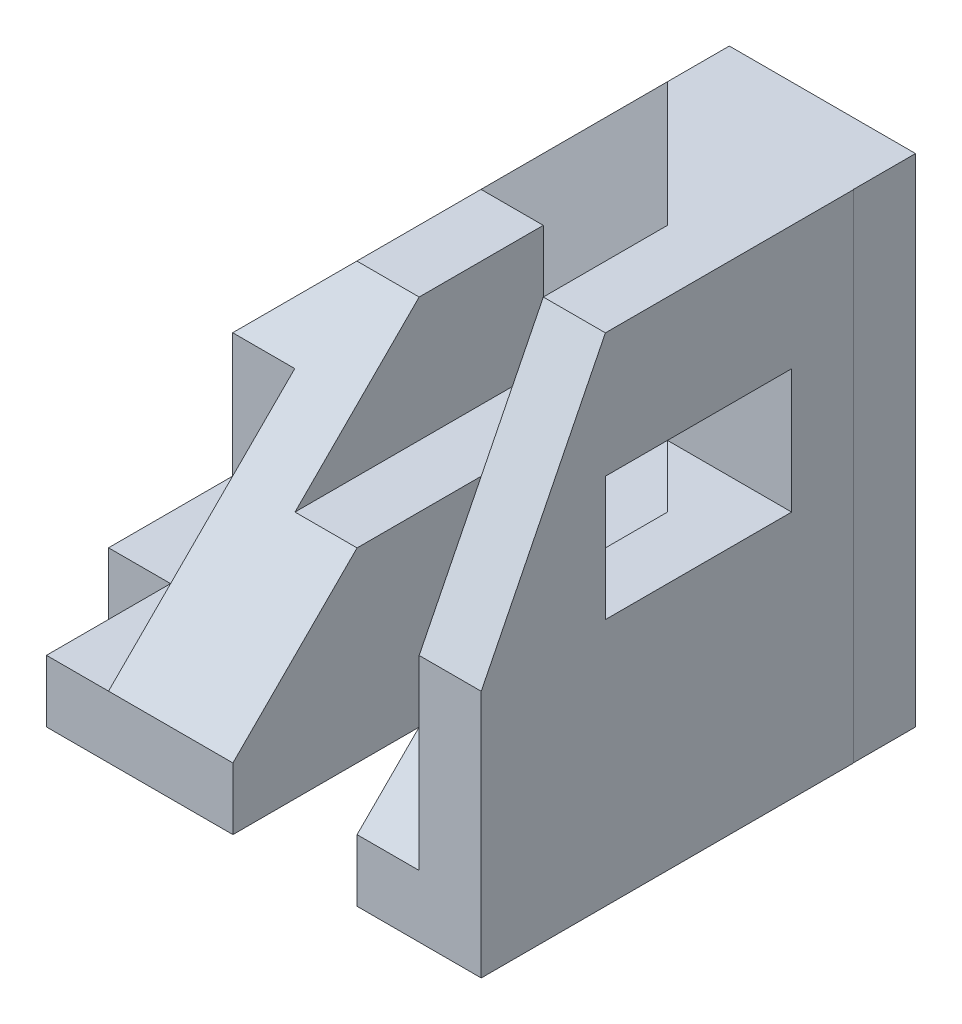
ISO-10303-21;
HEADER;
FILE_DESCRIPTION(('STEP AP214'),'2;1');
FILE_NAME('part.step','',(''),(''),'','','');
FILE_SCHEMA(('AUTOMOTIVE_DESIGN { 1 0 10303 214 1 1 1 1 }'));
ENDSEC;
DATA;
#1=APPLICATION_CONTEXT('core data for automotive mechanical design processes');
#2=APPLICATION_PROTOCOL_DEFINITION('international standard','automotive_design',2000,#1);
#3=PRODUCT_CONTEXT('',#1,'mechanical');
#4=PRODUCT('Part','Part','',(#3));
#5=PRODUCT_RELATED_PRODUCT_CATEGORY('part','',(#4));
#6=PRODUCT_DEFINITION_FORMATION('','',#4);
#7=PRODUCT_DEFINITION_CONTEXT('part definition',#1,'design');
#8=PRODUCT_DEFINITION('design','',#6,#7);
#9=PRODUCT_DEFINITION_SHAPE('','',#8);
#10=(LENGTH_UNIT() NAMED_UNIT(*) SI_UNIT(.MILLI.,.METRE.));
#11=(NAMED_UNIT(*) PLANE_ANGLE_UNIT() SI_UNIT($,.RADIAN.));
#12=(NAMED_UNIT(*) SI_UNIT($,.STERADIAN.) SOLID_ANGLE_UNIT());
#13=UNCERTAINTY_MEASURE_WITH_UNIT(LENGTH_MEASURE(1.E-05),#10,'distance_accuracy_value','');
#14=(GEOMETRIC_REPRESENTATION_CONTEXT(3) GLOBAL_UNCERTAINTY_ASSIGNED_CONTEXT((#13)) GLOBAL_UNIT_ASSIGNED_CONTEXT((#10,
#11,#12)) REPRESENTATION_CONTEXT('',''));
#15=CARTESIAN_POINT('',(0.,0.,0.));
#16=DIRECTION('',(0.,0.,1.));
#17=DIRECTION('',(1.,0.,0.));
#18=AXIS2_PLACEMENT_3D('',#15,#16,#17);
#19=CARTESIAN_POINT('',(0.,0.,1.));
#20=DIRECTION('',(0.,0.,-1.));
#21=DIRECTION('',(-1.,0.,0.));
#22=AXIS2_PLACEMENT_3D('',#19,#20,#21);
#23=PLANE('',#22);
#24=DIRECTION('',(0.,-1.,0.));
#25=VECTOR('',#24,1.);
#26=CARTESIAN_POINT('',(5.00380266007494,8.,1.));
#27=LINE('',#26,#25);
#28=CARTESIAN_POINT('',(5.00380266007494,8.,1.));
#29=VERTEX_POINT('',#28);
#30=CARTESIAN_POINT('',(5.00380266007494,3.,1.));
#31=VERTEX_POINT('',#30);
#32=EDGE_CURVE('E451',#29,#31,#27,.T.);
#33=ORIENTED_EDGE('',*,*,#32,.F.);
#34=DIRECTION('',(-1.,0.,0.));
#35=VECTOR('',#34,1.);
#36=CARTESIAN_POINT('',(5.,8.,1.));
#37=LINE('',#36,#35);
#38=CARTESIAN_POINT('',(5.,8.,1.));
#39=VERTEX_POINT('',#38);
#40=EDGE_CURVE('E514',#29,#39,#37,.T.);
#41=ORIENTED_EDGE('',*,*,#40,.T.);
#42=DIRECTION('',(-0.707106781186547,-0.707106781186548,0.));
#43=VECTOR('',#42,1.);
#44=CARTESIAN_POINT('',(0.,3.,1.));
#45=LINE('',#44,#43);
#46=CARTESIAN_POINT('',(2.,5.,1.));
#47=VERTEX_POINT('',#46);
#48=EDGE_CURVE('E510',#39,#47,#45,.T.);
#49=ORIENTED_EDGE('',*,*,#48,.T.);
#50=DIRECTION('',(-1.,0.,0.));
#51=VECTOR('',#50,1.);
#52=CARTESIAN_POINT('',(2.,5.,1.));
#53=LINE('',#52,#51);
#54=CARTESIAN_POINT('',(3.00380266007494,5.,1.));
#55=VERTEX_POINT('',#54);
#56=EDGE_CURVE('E420',#55,#47,#53,.T.);
#57=ORIENTED_EDGE('',*,*,#56,.F.);
#58=DIRECTION('',(0.,1.,0.));
#59=VECTOR('',#58,1.);
#60=CARTESIAN_POINT('',(3.00380266007494,5.,1.));
#61=LINE('',#60,#59);
#62=CARTESIAN_POINT('',(3.00380266007494,3.,1.));
#63=VERTEX_POINT('',#62);
#64=EDGE_CURVE('E409',#63,#55,#61,.T.);
#65=ORIENTED_EDGE('',*,*,#64,.F.);
#66=DIRECTION('',(-1.,0.,0.));
#67=VECTOR('',#66,1.);
#68=CARTESIAN_POINT('',(7.00380266007494,3.,1.));
#69=LINE('',#68,#67);
#70=EDGE_CURVE('E276',#31,#63,#69,.T.);
#71=ORIENTED_EDGE('',*,*,#70,.F.);
#72=EDGE_LOOP('',(#33,#41,#49,#57,#65,#71));
#73=FACE_BOUND('',#72,.T.);
#74=ADVANCED_FACE('F35',(#73),#23,.F.);
#75=CARTESIAN_POINT('',(7.00380266007494,0.,0.));
#76=DIRECTION('',(-1.,0.,0.));
#77=DIRECTION('',(0.,0.,1.));
#78=AXIS2_PLACEMENT_3D('',#75,#76,#77);
#79=PLANE('',#78);
#80=DIRECTION('',(0.,0.,1.));
#81=VECTOR('',#80,1.);
#82=CARTESIAN_POINT('',(7.00380266007494,8.,5.));
#83=LINE('',#82,#81);
#84=CARTESIAN_POINT('',(7.00380266007494,8.,3.));
#85=VERTEX_POINT('',#84);
#86=CARTESIAN_POINT('',(7.00380266007494,8.,5.));
#87=VERTEX_POINT('',#86);
#88=EDGE_CURVE('E306',#85,#87,#83,.T.);
#89=ORIENTED_EDGE('',*,*,#88,.F.);
#90=DIRECTION('',(0.,-1.,0.));
#91=VECTOR('',#90,1.);
#92=CARTESIAN_POINT('',(7.00380266007494,8.,3.));
#93=LINE('',#92,#91);
#94=CARTESIAN_POINT('',(7.00380266007494,6.,3.));
#95=VERTEX_POINT('',#94);
#96=EDGE_CURVE('E253',#85,#95,#93,.T.);
#97=ORIENTED_EDGE('',*,*,#96,.T.);
#98=DIRECTION('',(0.,0.,-1.));
#99=VECTOR('',#98,1.);
#100=CARTESIAN_POINT('',(7.00380266007494,6.,0.));
#101=LINE('',#100,#99);
#102=CARTESIAN_POINT('',(7.00380266007494,6.,5.));
#103=VERTEX_POINT('',#102);
#104=EDGE_CURVE('E261',#103,#95,#101,.T.);
#105=ORIENTED_EDGE('',*,*,#104,.F.);
#106=DIRECTION('',(0.,1.,0.));
#107=VECTOR('',#106,1.);
#108=CARTESIAN_POINT('',(7.00380266007494,0.,5.));
#109=LINE('',#108,#107);
#110=CARTESIAN_POINT('',(7.00380266007494,4.,5.));
#111=VERTEX_POINT('',#110);
#112=EDGE_CURVE('E260',#111,#103,#109,.T.);
#113=ORIENTED_EDGE('',*,*,#112,.F.);
#114=DIRECTION('',(0.,0.,1.));
#115=VECTOR('',#114,1.);
#116=CARTESIAN_POINT('',(7.00380266007494,4.,0.));
#117=LINE('',#116,#115);
#118=CARTESIAN_POINT('',(7.00380266007494,4.,3.));
#119=VERTEX_POINT('',#118);
#120=EDGE_CURVE('E240',#119,#111,#117,.T.);
#121=ORIENTED_EDGE('',*,*,#120,.F.);
#122=CARTESIAN_POINT('',(7.00380266007494,3.,3.));
#123=VERTEX_POINT('',#122);
#124=EDGE_CURVE('E246',#119,#123,#93,.T.);
#125=ORIENTED_EDGE('',*,*,#124,.T.);
#126=DIRECTION('',(0.,0.,-1.));
#127=VECTOR('',#126,1.);
#128=CARTESIAN_POINT('',(7.00380266007494,3.,1.));
#129=LINE('',#128,#127);
#130=CARTESIAN_POINT('',(7.00380266007494,3.,5.));
#131=VERTEX_POINT('',#130);
#132=EDGE_CURVE('E274',#131,#123,#129,.T.);
#133=ORIENTED_EDGE('',*,*,#132,.F.);
#134=DIRECTION('',(0.,-0.707106781186548,0.707106781186547));
#135=VECTOR('',#134,1.);
#136=CARTESIAN_POINT('',(7.00380266007494,1.,7.));
#137=LINE('',#136,#135);
#138=CARTESIAN_POINT('',(7.00380266007494,1.,7.));
#139=VERTEX_POINT('',#138);
#140=EDGE_CURVE('E346',#131,#139,#137,.T.);
#141=ORIENTED_EDGE('',*,*,#140,.T.);
#142=DIRECTION('',(0.,-1.,0.));
#143=VECTOR('',#142,1.);
#144=CARTESIAN_POINT('',(7.00380266007494,0.,7.));
#145=LINE('',#144,#143);
#146=CARTESIAN_POINT('',(7.00380266007494,4.,7.));
#147=VERTEX_POINT('',#146);
#148=EDGE_CURVE('E290',#147,#139,#145,.T.);
#149=ORIENTED_EDGE('',*,*,#148,.F.);
#150=DIRECTION('',(0.,-0.894427190999916,0.447213595499958));
#151=VECTOR('',#150,1.);
#152=CARTESIAN_POINT('',(7.00380266007494,4.,7.));
#153=LINE('',#152,#151);
#154=EDGE_CURVE('E295',#87,#147,#153,.T.);
#155=ORIENTED_EDGE('',*,*,#154,.F.);
#156=EDGE_LOOP('',(#89,#97,#105,#113,#121,#125,#133,#141,#149,#155));
#157=FACE_BOUND('',#156,.T.);
#158=ADVANCED_FACE('F258',(#157),#79,.T.);
#159=CARTESIAN_POINT('',(7.00380266007494,3.,1.));
#160=DIRECTION('',(0.,1.,0.));
#161=DIRECTION('',(0.,0.,1.));
#162=AXIS2_PLACEMENT_3D('',#159,#160,#161);
#163=PLANE('',#162);
#164=ORIENTED_EDGE('',*,*,#132,.T.);
#165=DIRECTION('',(0.707106781186548,0.,0.707106781186548));
#166=VECTOR('',#165,1.);
#167=CARTESIAN_POINT('',(7.00380266007494,3.,3.));
#168=LINE('',#167,#166);
#169=EDGE_CURVE('E249',#31,#123,#168,.T.);
#170=ORIENTED_EDGE('',*,*,#169,.F.);
#171=ORIENTED_EDGE('',*,*,#70,.T.);
#172=DIRECTION('',(0.,0.,-1.));
#173=VECTOR('',#172,1.);
#174=CARTESIAN_POINT('',(3.00380266007494,3.,1.));
#175=LINE('',#174,#173);
#176=CARTESIAN_POINT('',(3.00380266007494,3.,5.));
#177=VERTEX_POINT('',#176);
#178=EDGE_CURVE('E273',#177,#63,#175,.T.);
#179=ORIENTED_EDGE('',*,*,#178,.F.);
#180=DIRECTION('',(1.,0.,0.));
#181=VECTOR('',#180,1.);
#182=CARTESIAN_POINT('',(4.,3.,5.));
#183=LINE('',#182,#181);
#184=CARTESIAN_POINT('',(4.00380266007494,3.,5.));
#185=VERTEX_POINT('',#184);
#186=EDGE_CURVE('E288',#177,#185,#183,.T.);
#187=ORIENTED_EDGE('',*,*,#186,.T.);
#188=DIRECTION('',(0.,0.,-1.));
#189=VECTOR('',#188,1.);
#190=CARTESIAN_POINT('',(4.00380266007494,3.,3.));
#191=LINE('',#190,#189);
#192=CARTESIAN_POINT('',(4.00380266007494,3.,3.));
#193=VERTEX_POINT('',#192);
#194=EDGE_CURVE('E284',#185,#193,#191,.T.);
#195=ORIENTED_EDGE('',*,*,#194,.T.);
#196=DIRECTION('',(1.,0.,0.));
#197=VECTOR('',#196,1.);
#198=CARTESIAN_POINT('',(4.00380266007494,3.,3.));
#199=LINE('',#198,#197);
#200=CARTESIAN_POINT('',(6.00380266007494,3.,3.));
#201=VERTEX_POINT('',#200);
#202=EDGE_CURVE('E280',#193,#201,#199,.T.);
#203=ORIENTED_EDGE('',*,*,#202,.T.);
#204=DIRECTION('',(0.,0.,1.));
#205=VECTOR('',#204,1.);
#206=CARTESIAN_POINT('',(6.00380266007494,3.,3.));
#207=LINE('',#206,#205);
#208=CARTESIAN_POINT('',(6.00380266007494,3.,5.));
#209=VERTEX_POINT('',#208);
#210=EDGE_CURVE('E282',#201,#209,#207,.T.);
#211=ORIENTED_EDGE('',*,*,#210,.T.);
#212=DIRECTION('',(1.,0.,0.));
#213=VECTOR('',#212,1.);
#214=CARTESIAN_POINT('',(4.,3.,5.));
#215=LINE('',#214,#213);
#216=EDGE_CURVE('E286',#209,#131,#215,.T.);
#217=ORIENTED_EDGE('',*,*,#216,.T.);
#218=EDGE_LOOP('',(#164,#170,#171,#179,#187,#195,#203,#211,#217));
#219=FACE_BOUND('',#218,.T.);
#220=ADVANCED_FACE('F577',(#219),#163,.T.);
#221=CARTESIAN_POINT('',(4.,5.,3.));
#222=DIRECTION('',(0.,-0.707106781186547,-0.707106781186548));
#223=DIRECTION('',(0.,0.707106781186548,-0.707106781186547));
#224=AXIS2_PLACEMENT_3D('',#221,#222,#223);
#225=PLANE('',#224);
#226=ORIENTED_EDGE('',*,*,#186,.F.);
#227=DIRECTION('',(0.,-0.707106781186548,0.707106781186547));
#228=VECTOR('',#227,1.);
#229=CARTESIAN_POINT('',(3.00380266007494,3.,5.));
#230=LINE('',#229,#228);
#231=CARTESIAN_POINT('',(3.00380266007494,5.,3.));
#232=VERTEX_POINT('',#231);
#233=EDGE_CURVE('E405',#232,#177,#230,.T.);
#234=ORIENTED_EDGE('',*,*,#233,.F.);
#235=DIRECTION('',(-1.,0.,0.));
#236=VECTOR('',#235,1.);
#237=CARTESIAN_POINT('',(4.,5.,3.));
#238=LINE('',#237,#236);
#239=CARTESIAN_POINT('',(2.,5.,3.));
#240=VERTEX_POINT('',#239);
#241=EDGE_CURVE('E402',#232,#240,#238,.T.);
#242=ORIENTED_EDGE('',*,*,#241,.T.);
#243=DIRECTION('',(0.577350269189626,0.577350269189626,-0.577350269189626));
#244=VECTOR('',#243,1.);
#245=CARTESIAN_POINT('',(1.33333333333333,4.33333333333333,3.66666666666667));
#246=LINE('',#245,#244);
#247=CARTESIAN_POINT('',(1.,4.,4.));
#248=VERTEX_POINT('',#247);
#249=EDGE_CURVE('E407',#248,#240,#246,.T.);
#250=ORIENTED_EDGE('',*,*,#249,.F.);
#251=DIRECTION('',(1.,0.,0.));
#252=VECTOR('',#251,1.);
#253=CARTESIAN_POINT('',(4.,4.,4.));
#254=LINE('',#253,#252);
#255=CARTESIAN_POINT('',(2.,4.,4.));
#256=VERTEX_POINT('',#255);
#257=EDGE_CURVE('E243',#248,#256,#254,.T.);
#258=ORIENTED_EDGE('',*,*,#257,.T.);
#259=DIRECTION('',(0.,-0.707106781186548,0.707106781186547));
#260=VECTOR('',#259,1.);
#261=CARTESIAN_POINT('',(2.,5.,3.));
#262=LINE('',#261,#260);
#263=CARTESIAN_POINT('',(2.,1.,7.));
#264=VERTEX_POINT('',#263);
#265=EDGE_CURVE('E431',#256,#264,#262,.T.);
#266=ORIENTED_EDGE('',*,*,#265,.T.);
#267=DIRECTION('',(-1.,0.,0.));
#268=VECTOR('',#267,1.);
#269=CARTESIAN_POINT('',(0.,1.,7.));
#270=LINE('',#269,#268);
#271=CARTESIAN_POINT('',(4.00380266007494,1.,7.));
#272=VERTEX_POINT('',#271);
#273=EDGE_CURVE('E499',#272,#264,#270,.T.);
#274=ORIENTED_EDGE('',*,*,#273,.F.);
#275=DIRECTION('',(0.,0.707106781186548,-0.707106781186547));
#276=VECTOR('',#275,1.);
#277=CARTESIAN_POINT('',(4.00380266007494,5.,3.));
#278=LINE('',#277,#276);
#279=EDGE_CURVE('E343',#272,#185,#278,.T.);
#280=ORIENTED_EDGE('',*,*,#279,.T.);
#281=EDGE_LOOP('',(#226,#234,#242,#250,#258,#266,#274,#280));
#282=FACE_BOUND('',#281,.T.);
#283=ADVANCED_FACE('F561',(#282),#225,.F.);
#284=ORIENTED_EDGE('',*,*,#216,.F.);
#285=DIRECTION('',(0.,-0.707106781186548,0.707106781186547));
#286=VECTOR('',#285,1.);
#287=CARTESIAN_POINT('',(6.00380266007494,5.,3.));
#288=LINE('',#287,#286);
#289=CARTESIAN_POINT('',(6.00380266007494,1.,7.));
#290=VERTEX_POINT('',#289);
#291=EDGE_CURVE('E333',#209,#290,#288,.T.);
#292=ORIENTED_EDGE('',*,*,#291,.T.);
#293=EDGE_CURVE('E428',#139,#290,#270,.T.);
#294=ORIENTED_EDGE('',*,*,#293,.F.);
#295=ORIENTED_EDGE('',*,*,#140,.F.);
#296=EDGE_LOOP('',(#284,#292,#294,#295));
#297=FACE_BOUND('',#296,.T.);
#298=ADVANCED_FACE('F720',(#297),#225,.F.);
#299=CARTESIAN_POINT('',(4.00380266007494,0.,3.));
#300=DIRECTION('',(-1.,0.,0.));
#301=DIRECTION('',(0.,0.,1.));
#302=AXIS2_PLACEMENT_3D('',#299,#300,#301);
#303=PLANE('',#302);
#304=ORIENTED_EDGE('',*,*,#194,.F.);
#305=ORIENTED_EDGE('',*,*,#279,.F.);
#306=DIRECTION('',(0.,1.,0.));
#307=VECTOR('',#306,1.);
#308=CARTESIAN_POINT('',(4.00380266007494,0.,7.));
#309=LINE('',#308,#307);
#310=CARTESIAN_POINT('',(4.00380266007494,0.,7.));
#311=VERTEX_POINT('',#310);
#312=EDGE_CURVE('E329',#311,#272,#309,.T.);
#313=ORIENTED_EDGE('',*,*,#312,.F.);
#314=DIRECTION('',(0.,0.,1.));
#315=VECTOR('',#314,1.);
#316=CARTESIAN_POINT('',(4.00380266007494,0.,3.));
#317=LINE('',#316,#315);
#318=CARTESIAN_POINT('',(4.00380266007494,0.,3.));
#319=VERTEX_POINT('',#318);
#320=EDGE_CURVE('E320',#319,#311,#317,.T.);
#321=ORIENTED_EDGE('',*,*,#320,.F.);
#322=DIRECTION('',(0.,1.,0.));
#323=VECTOR('',#322,1.);
#324=CARTESIAN_POINT('',(4.00380266007494,0.,3.));
#325=LINE('',#324,#323);
#326=EDGE_CURVE('E330',#319,#193,#325,.T.);
#327=ORIENTED_EDGE('',*,*,#326,.T.);
#328=EDGE_LOOP('',(#304,#305,#313,#321,#327));
#329=FACE_BOUND('',#328,.T.);
#330=ADVANCED_FACE('F711',(#329),#303,.F.);
#331=CARTESIAN_POINT('',(6.00380266007494,0.,3.));
#332=DIRECTION('',(1.,0.,0.));
#333=DIRECTION('',(0.,0.,-1.));
#334=AXIS2_PLACEMENT_3D('',#331,#332,#333);
#335=PLANE('',#334);
#336=ORIENTED_EDGE('',*,*,#210,.F.);
#337=DIRECTION('',(0.,1.,0.));
#338=VECTOR('',#337,1.);
#339=CARTESIAN_POINT('',(6.00380266007494,0.,3.));
#340=LINE('',#339,#338);
#341=CARTESIAN_POINT('',(6.00380266007494,0.,3.));
#342=VERTEX_POINT('',#341);
#343=EDGE_CURVE('E334',#342,#201,#340,.T.);
#344=ORIENTED_EDGE('',*,*,#343,.F.);
#345=DIRECTION('',(0.,0.,-1.));
#346=VECTOR('',#345,1.);
#347=CARTESIAN_POINT('',(6.00380266007494,0.,3.));
#348=LINE('',#347,#346);
#349=CARTESIAN_POINT('',(6.00380266007494,0.,7.));
#350=VERTEX_POINT('',#349);
#351=EDGE_CURVE('E323',#350,#342,#348,.T.);
#352=ORIENTED_EDGE('',*,*,#351,.F.);
#353=DIRECTION('',(0.,1.,0.));
#354=VECTOR('',#353,1.);
#355=CARTESIAN_POINT('',(6.00380266007494,0.,7.));
#356=LINE('',#355,#354);
#357=EDGE_CURVE('E337',#350,#290,#356,.T.);
#358=ORIENTED_EDGE('',*,*,#357,.T.);
#359=ORIENTED_EDGE('',*,*,#291,.F.);
#360=EDGE_LOOP('',(#336,#344,#352,#358,#359));
#361=FACE_BOUND('',#360,.T.);
#362=ADVANCED_FACE('F702',(#361),#335,.F.);
#363=CARTESIAN_POINT('',(4.00380266007494,0.,3.));
#364=DIRECTION('',(0.,0.,-1.));
#365=DIRECTION('',(-1.,0.,0.));
#366=AXIS2_PLACEMENT_3D('',#363,#364,#365);
#367=PLANE('',#366);
#368=ORIENTED_EDGE('',*,*,#202,.F.);
#369=ORIENTED_EDGE('',*,*,#326,.F.);
#370=DIRECTION('',(-1.,0.,0.));
#371=VECTOR('',#370,1.);
#372=CARTESIAN_POINT('',(4.00380266007494,0.,3.));
#373=LINE('',#372,#371);
#374=EDGE_CURVE('E326',#342,#319,#373,.T.);
#375=ORIENTED_EDGE('',*,*,#374,.F.);
#376=ORIENTED_EDGE('',*,*,#343,.T.);
#377=EDGE_LOOP('',(#368,#369,#375,#376));
#378=FACE_BOUND('',#377,.T.);
#379=ADVANCED_FACE('F698',(#378),#367,.F.);
#380=CARTESIAN_POINT('',(0.,0.,7.));
#381=DIRECTION('',(0.,0.,-1.));
#382=DIRECTION('',(-1.,0.,0.));
#383=AXIS2_PLACEMENT_3D('',#380,#381,#382);
#384=PLANE('',#383);
#385=DIRECTION('',(1.,0.,0.));
#386=VECTOR('',#385,1.);
#387=CARTESIAN_POINT('',(3.00380266007494,0.,7.));
#388=LINE('',#387,#386);
#389=CARTESIAN_POINT('',(1.,0.,7.));
#390=VERTEX_POINT('',#389);
#391=EDGE_CURVE('E410',#390,#311,#388,.T.);
#392=ORIENTED_EDGE('',*,*,#391,.T.);
#393=ORIENTED_EDGE('',*,*,#312,.T.);
#394=ORIENTED_EDGE('',*,*,#273,.T.);
#395=DIRECTION('',(1.,0.,0.));
#396=VECTOR('',#395,1.);
#397=CARTESIAN_POINT('',(0.,1.,7.));
#398=LINE('',#397,#396);
#399=CARTESIAN_POINT('',(1.,1.,7.));
#400=VERTEX_POINT('',#399);
#401=EDGE_CURVE('E378',#400,#264,#398,.T.);
#402=ORIENTED_EDGE('',*,*,#401,.F.);
#403=DIRECTION('',(0.,1.,0.));
#404=VECTOR('',#403,1.);
#405=CARTESIAN_POINT('',(1.,-3.,7.));
#406=LINE('',#405,#404);
#407=EDGE_CURVE('E353',#390,#400,#406,.T.);
#408=ORIENTED_EDGE('',*,*,#407,.F.);
#409=EDGE_LOOP('',(#392,#393,#394,#402,#408));
#410=FACE_BOUND('',#409,.T.);
#411=ADVANCED_FACE('F625',(#410),#384,.F.);
#412=CARTESIAN_POINT('',(3.00380266007494,5.,7.));
#413=DIRECTION('',(-1.,0.,0.));
#414=DIRECTION('',(0.,0.,1.));
#415=AXIS2_PLACEMENT_3D('',#412,#413,#414);
#416=PLANE('',#415);
#417=ORIENTED_EDGE('',*,*,#233,.T.);
#418=ORIENTED_EDGE('',*,*,#178,.T.);
#419=ORIENTED_EDGE('',*,*,#64,.T.);
#420=DIRECTION('',(0.,0.,-1.));
#421=VECTOR('',#420,1.);
#422=CARTESIAN_POINT('',(3.00380266007494,5.,7.));
#423=LINE('',#422,#421);
#424=EDGE_CURVE('E417',#232,#55,#423,.T.);
#425=ORIENTED_EDGE('',*,*,#424,.F.);
#426=EDGE_LOOP('',(#417,#418,#419,#425));
#427=FACE_BOUND('',#426,.T.);
#428=ADVANCED_FACE('F573',(#427),#416,.F.);
#429=CARTESIAN_POINT('',(8.,0.,1.));
#430=DIRECTION('',(0.,1.,0.));
#431=DIRECTION('',(-1.,0.,0.));
#432=AXIS2_PLACEMENT_3D('',#429,#430,#431);
#433=PLANE('',#432);
#434=DIRECTION('',(0.,0.,-1.));
#435=VECTOR('',#434,1.);
#436=CARTESIAN_POINT('',(8.,0.,1.));
#437=LINE('',#436,#435);
#438=CARTESIAN_POINT('',(8.,0.,1.));
#439=VERTEX_POINT('',#438);
#440=CARTESIAN_POINT('',(8.,0.,0.));
#441=VERTEX_POINT('',#440);
#442=EDGE_CURVE('E485',#439,#441,#437,.T.);
#443=ORIENTED_EDGE('',*,*,#442,.F.);
#444=DIRECTION('',(-1.,0.,0.));
#445=VECTOR('',#444,1.);
#446=CARTESIAN_POINT('',(8.00380266007494,0.,1.));
#447=LINE('',#446,#445);
#448=CARTESIAN_POINT('',(8.00380266007494,0.,1.));
#449=VERTEX_POINT('',#448);
#450=EDGE_CURVE('E317',#449,#439,#447,.T.);
#451=ORIENTED_EDGE('',*,*,#450,.F.);
#452=DIRECTION('',(0.,0.,-1.));
#453=VECTOR('',#452,1.);
#454=CARTESIAN_POINT('',(8.00380266007494,0.,7.));
#455=LINE('',#454,#453);
#456=CARTESIAN_POINT('',(8.00380266007494,0.,7.));
#457=VERTEX_POINT('',#456);
#458=EDGE_CURVE('E294',#457,#449,#455,.T.);
#459=ORIENTED_EDGE('',*,*,#458,.F.);
#460=EDGE_CURVE('E414',#350,#457,#388,.T.);
#461=ORIENTED_EDGE('',*,*,#460,.F.);
#462=ORIENTED_EDGE('',*,*,#351,.T.);
#463=ORIENTED_EDGE('',*,*,#374,.T.);
#464=ORIENTED_EDGE('',*,*,#320,.T.);
#465=ORIENTED_EDGE('',*,*,#391,.F.);
#466=DIRECTION('',(0.,0.,-1.));
#467=VECTOR('',#466,1.);
#468=CARTESIAN_POINT('',(1.,0.,1.));
#469=LINE('',#468,#467);
#470=CARTESIAN_POINT('',(1.,0.,5.));
#471=VERTEX_POINT('',#470);
#472=EDGE_CURVE('E357',#390,#471,#469,.T.);
#473=ORIENTED_EDGE('',*,*,#472,.T.);
#474=DIRECTION('',(-1.,0.,0.));
#475=VECTOR('',#474,1.);
#476=CARTESIAN_POINT('',(8.,0.,5.));
#477=LINE('',#476,#475);
#478=CARTESIAN_POINT('',(0.,0.,5.));
#479=VERTEX_POINT('',#478);
#480=EDGE_CURVE('E363',#471,#479,#477,.T.);
#481=ORIENTED_EDGE('',*,*,#480,.T.);
#482=DIRECTION('',(0.,0.,-1.));
#483=VECTOR('',#482,1.);
#484=CARTESIAN_POINT('',(0.,0.,1.));
#485=LINE('',#484,#483);
#486=CARTESIAN_POINT('',(0.,0.,0.));
#487=VERTEX_POINT('',#486);
#488=EDGE_CURVE('E513',#479,#487,#485,.T.);
#489=ORIENTED_EDGE('',*,*,#488,.T.);
#490=DIRECTION('',(1.,0.,0.));
#491=VECTOR('',#490,1.);
#492=CARTESIAN_POINT('',(8.,0.,0.));
#493=LINE('',#492,#491);
#494=EDGE_CURVE('E518',#487,#441,#493,.T.);
#495=ORIENTED_EDGE('',*,*,#494,.T.);
#496=EDGE_LOOP('',(#443,#451,#459,#461,#462,#463,#464,#465,#473,#481,#489,#495));
#497=FACE_BOUND('',#496,.T.);
#498=ADVANCED_FACE('F37',(#497),#433,.F.);
#499=CARTESIAN_POINT('',(8.,8.,1.));
#500=DIRECTION('',(-1.,0.,0.));
#501=DIRECTION('',(0.,-1.,0.));
#502=AXIS2_PLACEMENT_3D('',#499,#500,#501);
#503=PLANE('',#502);
#504=DIRECTION('',(0.,1.,0.));
#505=VECTOR('',#504,1.);
#506=CARTESIAN_POINT('',(8.,8.,0.));
#507=LINE('',#506,#505);
#508=CARTESIAN_POINT('',(8.,8.,0.));
#509=VERTEX_POINT('',#508);
#510=EDGE_CURVE('E520',#441,#509,#507,.T.);
#511=ORIENTED_EDGE('',*,*,#510,.T.);
#512=DIRECTION('',(0.,0.,-1.));
#513=VECTOR('',#512,1.);
#514=CARTESIAN_POINT('',(8.,8.,1.));
#515=LINE('',#514,#513);
#516=CARTESIAN_POINT('',(8.,8.,1.));
#517=VERTEX_POINT('',#516);
#518=EDGE_CURVE('E503',#517,#509,#515,.T.);
#519=ORIENTED_EDGE('',*,*,#518,.F.);
#520=DIRECTION('',(0.,1.,0.));
#521=VECTOR('',#520,1.);
#522=CARTESIAN_POINT('',(8.,8.,1.));
#523=LINE('',#522,#521);
#524=EDGE_CURVE('E530',#439,#517,#523,.T.);
#525=ORIENTED_EDGE('',*,*,#524,.F.);
#526=ORIENTED_EDGE('',*,*,#442,.T.);
#527=EDGE_LOOP('',(#511,#519,#525,#526));
#528=FACE_BOUND('',#527,.T.);
#529=ADVANCED_FACE('F578',(#528),#503,.F.);
#530=CARTESIAN_POINT('',(5.,8.,1.));
#531=DIRECTION('',(0.,-1.,0.));
#532=DIRECTION('',(0.,0.,-1.));
#533=AXIS2_PLACEMENT_3D('',#530,#531,#532);
#534=PLANE('',#533);
#535=ORIENTED_EDGE('',*,*,#40,.F.);
#536=DIRECTION('',(0.707106781186548,0.,0.707106781186548));
#537=VECTOR('',#536,1.);
#538=CARTESIAN_POINT('',(7.00380266007494,8.,3.));
#539=LINE('',#538,#537);
#540=EDGE_CURVE('E254',#29,#85,#539,.T.);
#541=ORIENTED_EDGE('',*,*,#540,.T.);
#542=ORIENTED_EDGE('',*,*,#88,.T.);
#543=DIRECTION('',(-1.,0.,0.));
#544=VECTOR('',#543,1.);
#545=CARTESIAN_POINT('',(8.00380266007494,8.,5.));
#546=LINE('',#545,#544);
#547=CARTESIAN_POINT('',(8.00380266007494,8.,5.));
#548=VERTEX_POINT('',#547);
#549=EDGE_CURVE('E311',#548,#87,#546,.T.);
#550=ORIENTED_EDGE('',*,*,#549,.F.);
#551=DIRECTION('',(0.,0.,1.));
#552=VECTOR('',#551,1.);
#553=CARTESIAN_POINT('',(8.00380266007494,8.,5.));
#554=LINE('',#553,#552);
#555=CARTESIAN_POINT('',(8.00380266007494,8.,1.));
#556=VERTEX_POINT('',#555);
#557=EDGE_CURVE('E299',#556,#548,#554,.T.);
#558=ORIENTED_EDGE('',*,*,#557,.F.);
#559=DIRECTION('',(-1.,0.,0.));
#560=VECTOR('',#559,1.);
#561=CARTESIAN_POINT('',(8.00380266007494,8.,1.));
#562=LINE('',#561,#560);
#563=EDGE_CURVE('E314',#556,#517,#562,.T.);
#564=ORIENTED_EDGE('',*,*,#563,.T.);
#565=ORIENTED_EDGE('',*,*,#518,.T.);
#566=DIRECTION('',(-1.,0.,0.));
#567=VECTOR('',#566,1.);
#568=CARTESIAN_POINT('',(5.,8.,0.));
#569=LINE('',#568,#567);
#570=CARTESIAN_POINT('',(5.,8.,0.));
#571=VERTEX_POINT('',#570);
#572=EDGE_CURVE('E522',#509,#571,#569,.T.);
#573=ORIENTED_EDGE('',*,*,#572,.T.);
#574=DIRECTION('',(0.,0.,-1.));
#575=VECTOR('',#574,1.);
#576=CARTESIAN_POINT('',(5.,8.,1.));
#577=LINE('',#576,#575);
#578=EDGE_CURVE('E507',#39,#571,#577,.T.);
#579=ORIENTED_EDGE('',*,*,#578,.F.);
#580=EDGE_LOOP('',(#535,#541,#542,#550,#558,#564,#565,#573,#579));
#581=FACE_BOUND('',#580,.T.);
#582=ADVANCED_FACE('F494',(#581),#534,.F.);
#583=CARTESIAN_POINT('',(0.,3.,1.));
#584=DIRECTION('',(0.707106781186548,-0.707106781186547,0.));
#585=DIRECTION('',(0.707106781186547,0.707106781186548,0.));
#586=AXIS2_PLACEMENT_3D('',#583,#584,#585);
#587=PLANE('',#586);
#588=DIRECTION('',(0.,0.,-1.));
#589=VECTOR('',#588,1.);
#590=CARTESIAN_POINT('',(0.,3.,1.));
#591=LINE('',#590,#589);
#592=CARTESIAN_POINT('',(0.,3.,3.));
#593=VERTEX_POINT('',#592);
#594=CARTESIAN_POINT('',(0.,3.,0.));
#595=VERTEX_POINT('',#594);
#596=EDGE_CURVE('E532',#593,#595,#591,.T.);
#597=ORIENTED_EDGE('',*,*,#596,.F.);
#598=DIRECTION('',(0.707106781186547,0.707106781186548,0.));
#599=VECTOR('',#598,1.);
#600=CARTESIAN_POINT('',(0.,3.,3.));
#601=LINE('',#600,#599);
#602=CARTESIAN_POINT('',(1.,4.,3.));
#603=VERTEX_POINT('',#602);
#604=EDGE_CURVE('E399',#593,#603,#601,.T.);
#605=ORIENTED_EDGE('',*,*,#604,.T.);
#606=DIRECTION('',(0.,0.,1.));
#607=VECTOR('',#606,1.);
#608=CARTESIAN_POINT('',(1.,4.,1.));
#609=LINE('',#608,#607);
#610=EDGE_CURVE('E388',#603,#248,#609,.T.);
#611=ORIENTED_EDGE('',*,*,#610,.T.);
#612=ORIENTED_EDGE('',*,*,#249,.T.);
#613=DIRECTION('',(0.,0.,-1.));
#614=VECTOR('',#613,1.);
#615=CARTESIAN_POINT('',(2.,5.,7.));
#616=LINE('',#615,#614);
#617=EDGE_CURVE('E413',#240,#47,#616,.T.);
#618=ORIENTED_EDGE('',*,*,#617,.T.);
#619=ORIENTED_EDGE('',*,*,#48,.F.);
#620=ORIENTED_EDGE('',*,*,#578,.T.);
#621=DIRECTION('',(-0.707106781186547,-0.707106781186548,0.));
#622=VECTOR('',#621,1.);
#623=CARTESIAN_POINT('',(0.,3.,0.));
#624=LINE('',#623,#622);
#625=EDGE_CURVE('E524',#571,#595,#624,.T.);
#626=ORIENTED_EDGE('',*,*,#625,.T.);
#627=EDGE_LOOP('',(#597,#605,#611,#612,#618,#619,#620,#626));
#628=FACE_BOUND('',#627,.T.);
#629=ADVANCED_FACE('F539',(#628),#587,.F.);
#630=CARTESIAN_POINT('',(0.,0.,1.));
#631=DIRECTION('',(1.,0.,0.));
#632=DIRECTION('',(0.,0.,-1.));
#633=AXIS2_PLACEMENT_3D('',#630,#631,#632);
#634=PLANE('',#633);
#635=ORIENTED_EDGE('',*,*,#488,.F.);
#636=DIRECTION('',(0.,1.,0.));
#637=VECTOR('',#636,1.);
#638=CARTESIAN_POINT('',(0.,-3.,5.));
#639=LINE('',#638,#637);
#640=CARTESIAN_POINT('',(0.,1.,5.));
#641=VERTEX_POINT('',#640);
#642=EDGE_CURVE('E354',#479,#641,#639,.T.);
#643=ORIENTED_EDGE('',*,*,#642,.T.);
#644=DIRECTION('',(0.,0.,1.));
#645=VECTOR('',#644,1.);
#646=CARTESIAN_POINT('',(0.,1.,3.));
#647=LINE('',#646,#645);
#648=CARTESIAN_POINT('',(0.,1.,3.));
#649=VERTEX_POINT('',#648);
#650=EDGE_CURVE('E375',#649,#641,#647,.T.);
#651=ORIENTED_EDGE('',*,*,#650,.F.);
#652=DIRECTION('',(0.,1.,0.));
#653=VECTOR('',#652,1.);
#654=CARTESIAN_POINT('',(0.,1.,3.));
#655=LINE('',#654,#653);
#656=EDGE_CURVE('E389',#649,#593,#655,.T.);
#657=ORIENTED_EDGE('',*,*,#656,.T.);
#658=ORIENTED_EDGE('',*,*,#596,.T.);
#659=DIRECTION('',(0.,-1.,0.));
#660=VECTOR('',#659,1.);
#661=CARTESIAN_POINT('',(0.,0.,0.));
#662=LINE('',#661,#660);
#663=EDGE_CURVE('E527',#595,#487,#662,.T.);
#664=ORIENTED_EDGE('',*,*,#663,.T.);
#665=EDGE_LOOP('',(#635,#643,#651,#657,#658,#664));
#666=FACE_BOUND('',#665,.T.);
#667=ADVANCED_FACE('F547',(#666),#634,.F.);
#668=CARTESIAN_POINT('',(0.,0.,0.));
#669=DIRECTION('',(0.,0.,-1.));
#670=DIRECTION('',(-1.,0.,0.));
#671=AXIS2_PLACEMENT_3D('',#668,#669,#670);
#672=PLANE('',#671);
#673=ORIENTED_EDGE('',*,*,#494,.F.);
#674=ORIENTED_EDGE('',*,*,#663,.F.);
#675=ORIENTED_EDGE('',*,*,#625,.F.);
#676=ORIENTED_EDGE('',*,*,#572,.F.);
#677=ORIENTED_EDGE('',*,*,#510,.F.);
#678=EDGE_LOOP('',(#673,#674,#675,#676,#677));
#679=FACE_BOUND('',#678,.T.);
#680=ADVANCED_FACE('F544',(#679),#672,.T.);
#681=CARTESIAN_POINT('',(2.,5.,7.));
#682=DIRECTION('',(0.,-1.,0.));
#683=DIRECTION('',(0.,0.,-1.));
#684=AXIS2_PLACEMENT_3D('',#681,#682,#683);
#685=PLANE('',#684);
#686=ORIENTED_EDGE('',*,*,#617,.F.);
#687=ORIENTED_EDGE('',*,*,#241,.F.);
#688=ORIENTED_EDGE('',*,*,#424,.T.);
#689=ORIENTED_EDGE('',*,*,#56,.T.);
#690=EDGE_LOOP('',(#686,#687,#688,#689));
#691=FACE_BOUND('',#690,.T.);
#692=ADVANCED_FACE('F570',(#691),#685,.F.);
#693=ORIENTED_EDGE('',*,*,#293,.T.);
#694=ORIENTED_EDGE('',*,*,#357,.F.);
#695=ORIENTED_EDGE('',*,*,#460,.T.);
#696=DIRECTION('',(0.,-1.,0.));
#697=VECTOR('',#696,1.);
#698=CARTESIAN_POINT('',(8.00380266007494,0.,7.));
#699=LINE('',#698,#697);
#700=CARTESIAN_POINT('',(8.00380266007494,4.,7.));
#701=VERTEX_POINT('',#700);
#702=EDGE_CURVE('E291',#701,#457,#699,.T.);
#703=ORIENTED_EDGE('',*,*,#702,.F.);
#704=DIRECTION('',(-1.,0.,0.));
#705=VECTOR('',#704,1.);
#706=CARTESIAN_POINT('',(8.00380266007494,4.,7.));
#707=LINE('',#706,#705);
#708=EDGE_CURVE('E303',#701,#147,#707,.T.);
#709=ORIENTED_EDGE('',*,*,#708,.T.);
#710=ORIENTED_EDGE('',*,*,#148,.T.);
#711=EDGE_LOOP('',(#693,#694,#695,#703,#709,#710));
#712=FACE_BOUND('',#711,.T.);
#713=ADVANCED_FACE('F476',(#712),#384,.F.);
#714=CARTESIAN_POINT('',(1.,1.,3.));
#715=DIRECTION('',(0.,0.,-1.));
#716=DIRECTION('',(-1.,0.,0.));
#717=AXIS2_PLACEMENT_3D('',#714,#715,#716);
#718=PLANE('',#717);
#719=ORIENTED_EDGE('',*,*,#656,.F.);
#720=DIRECTION('',(-1.,0.,0.));
#721=VECTOR('',#720,1.);
#722=CARTESIAN_POINT('',(1.,1.,3.));
#723=LINE('',#722,#721);
#724=CARTESIAN_POINT('',(1.,1.,3.));
#725=VERTEX_POINT('',#724);
#726=EDGE_CURVE('E372',#725,#649,#723,.T.);
#727=ORIENTED_EDGE('',*,*,#726,.F.);
#728=DIRECTION('',(0.,1.,0.));
#729=VECTOR('',#728,1.);
#730=CARTESIAN_POINT('',(1.,1.,3.));
#731=LINE('',#730,#729);
#732=EDGE_CURVE('E392',#725,#603,#731,.T.);
#733=ORIENTED_EDGE('',*,*,#732,.T.);
#734=ORIENTED_EDGE('',*,*,#604,.F.);
#735=EDGE_LOOP('',(#719,#727,#733,#734));
#736=FACE_BOUND('',#735,.T.);
#737=ADVANCED_FACE('F551',(#736),#718,.F.);
#738=CARTESIAN_POINT('',(2.,1.,4.));
#739=DIRECTION('',(0.,0.,-1.));
#740=DIRECTION('',(-1.,0.,0.));
#741=AXIS2_PLACEMENT_3D('',#738,#739,#740);
#742=PLANE('',#741);
#743=DIRECTION('',(0.,1.,0.));
#744=VECTOR('',#743,1.);
#745=CARTESIAN_POINT('',(1.,1.,4.));
#746=LINE('',#745,#744);
#747=CARTESIAN_POINT('',(1.,1.,4.));
#748=VERTEX_POINT('',#747);
#749=EDGE_CURVE('E384',#748,#248,#746,.T.);
#750=ORIENTED_EDGE('',*,*,#749,.F.);
#751=DIRECTION('',(-1.,0.,0.));
#752=VECTOR('',#751,1.);
#753=CARTESIAN_POINT('',(2.,1.,4.));
#754=LINE('',#753,#752);
#755=CARTESIAN_POINT('',(2.,1.,4.));
#756=VERTEX_POINT('',#755);
#757=EDGE_CURVE('E366',#756,#748,#754,.T.);
#758=ORIENTED_EDGE('',*,*,#757,.F.);
#759=DIRECTION('',(0.,1.,0.));
#760=VECTOR('',#759,1.);
#761=CARTESIAN_POINT('',(2.,1.,4.));
#762=LINE('',#761,#760);
#763=EDGE_CURVE('E385',#756,#256,#762,.T.);
#764=ORIENTED_EDGE('',*,*,#763,.T.);
#765=ORIENTED_EDGE('',*,*,#257,.F.);
#766=EDGE_LOOP('',(#750,#758,#764,#765));
#767=FACE_BOUND('',#766,.T.);
#768=ADVANCED_FACE('F558',(#767),#742,.F.);
#769=CARTESIAN_POINT('',(2.,1.,7.));
#770=DIRECTION('',(1.,0.,0.));
#771=DIRECTION('',(0.,0.,-1.));
#772=AXIS2_PLACEMENT_3D('',#769,#770,#771);
#773=PLANE('',#772);
#774=ORIENTED_EDGE('',*,*,#763,.F.);
#775=DIRECTION('',(0.,0.,-1.));
#776=VECTOR('',#775,1.);
#777=CARTESIAN_POINT('',(2.,1.,7.));
#778=LINE('',#777,#776);
#779=EDGE_CURVE('E381',#264,#756,#778,.T.);
#780=ORIENTED_EDGE('',*,*,#779,.F.);
#781=ORIENTED_EDGE('',*,*,#265,.F.);
#782=EDGE_LOOP('',(#774,#780,#781));
#783=FACE_BOUND('',#782,.T.);
#784=ADVANCED_FACE('F637',(#783),#773,.F.);
#785=CARTESIAN_POINT('',(1.,1.,4.));
#786=DIRECTION('',(1.,0.,0.));
#787=DIRECTION('',(0.,0.,-1.));
#788=AXIS2_PLACEMENT_3D('',#785,#786,#787);
#789=PLANE('',#788);
#790=ORIENTED_EDGE('',*,*,#732,.F.);
#791=DIRECTION('',(0.,0.,-1.));
#792=VECTOR('',#791,1.);
#793=CARTESIAN_POINT('',(1.,1.,4.));
#794=LINE('',#793,#792);
#795=EDGE_CURVE('E369',#748,#725,#794,.T.);
#796=ORIENTED_EDGE('',*,*,#795,.F.);
#797=ORIENTED_EDGE('',*,*,#749,.T.);
#798=ORIENTED_EDGE('',*,*,#610,.F.);
#799=EDGE_LOOP('',(#790,#796,#797,#798));
#800=FACE_BOUND('',#799,.T.);
#801=ADVANCED_FACE('F555',(#800),#789,.F.);
#802=CARTESIAN_POINT('',(0.,1.,0.));
#803=DIRECTION('',(0.,-1.,0.));
#804=DIRECTION('',(0.,0.,-1.));
#805=AXIS2_PLACEMENT_3D('',#802,#803,#804);
#806=PLANE('',#805);
#807=ORIENTED_EDGE('',*,*,#650,.T.);
#808=DIRECTION('',(-1.,0.,0.));
#809=VECTOR('',#808,1.);
#810=CARTESIAN_POINT('',(1.,1.,5.));
#811=LINE('',#810,#809);
#812=CARTESIAN_POINT('',(1.,1.,5.));
#813=VERTEX_POINT('',#812);
#814=EDGE_CURVE('E351',#813,#641,#811,.T.);
#815=ORIENTED_EDGE('',*,*,#814,.F.);
#816=DIRECTION('',(0.,0.,-1.));
#817=VECTOR('',#816,1.);
#818=CARTESIAN_POINT('',(1.,1.,7.));
#819=LINE('',#818,#817);
#820=EDGE_CURVE('E348',#400,#813,#819,.T.);
#821=ORIENTED_EDGE('',*,*,#820,.F.);
#822=ORIENTED_EDGE('',*,*,#401,.T.);
#823=ORIENTED_EDGE('',*,*,#779,.T.);
#824=ORIENTED_EDGE('',*,*,#757,.T.);
#825=ORIENTED_EDGE('',*,*,#795,.T.);
#826=ORIENTED_EDGE('',*,*,#726,.T.);
#827=EDGE_LOOP('',(#807,#815,#821,#822,#823,#824,#825,#826));
#828=FACE_BOUND('',#827,.T.);
#829=ADVANCED_FACE('F650',(#828),#806,.F.);
#830=CARTESIAN_POINT('',(1.,-3.,5.));
#831=DIRECTION('',(0.,0.,-1.));
#832=DIRECTION('',(-1.,0.,0.));
#833=AXIS2_PLACEMENT_3D('',#830,#831,#832);
#834=PLANE('',#833);
#835=DIRECTION('',(0.,1.,0.));
#836=VECTOR('',#835,1.);
#837=CARTESIAN_POINT('',(1.,-3.,5.));
#838=LINE('',#837,#836);
#839=EDGE_CURVE('E358',#471,#813,#838,.T.);
#840=ORIENTED_EDGE('',*,*,#839,.T.);
#841=ORIENTED_EDGE('',*,*,#814,.T.);
#842=ORIENTED_EDGE('',*,*,#642,.F.);
#843=ORIENTED_EDGE('',*,*,#480,.F.);
#844=EDGE_LOOP('',(#840,#841,#842,#843));
#845=FACE_BOUND('',#844,.T.);
#846=ADVANCED_FACE('F656',(#845),#834,.F.);
#847=CARTESIAN_POINT('',(1.,-3.,7.));
#848=DIRECTION('',(1.,0.,0.));
#849=DIRECTION('',(0.,0.,-1.));
#850=AXIS2_PLACEMENT_3D('',#847,#848,#849);
#851=PLANE('',#850);
#852=ORIENTED_EDGE('',*,*,#407,.T.);
#853=ORIENTED_EDGE('',*,*,#820,.T.);
#854=ORIENTED_EDGE('',*,*,#839,.F.);
#855=ORIENTED_EDGE('',*,*,#472,.F.);
#856=EDGE_LOOP('',(#852,#853,#854,#855));
#857=FACE_BOUND('',#856,.T.);
#858=ADVANCED_FACE('F664',(#857),#851,.F.);
#859=CARTESIAN_POINT('',(8.00380266007494,0.,1.));
#860=DIRECTION('',(0.,0.,1.));
#861=DIRECTION('',(1.,0.,0.));
#862=AXIS2_PLACEMENT_3D('',#859,#860,#861);
#863=PLANE('',#862);
#864=ORIENTED_EDGE('',*,*,#450,.T.);
#865=ORIENTED_EDGE('',*,*,#524,.T.);
#866=ORIENTED_EDGE('',*,*,#563,.F.);
#867=DIRECTION('',(0.,1.,0.));
#868=VECTOR('',#867,1.);
#869=CARTESIAN_POINT('',(8.00380266007494,0.,1.));
#870=LINE('',#869,#868);
#871=EDGE_CURVE('E297',#449,#556,#870,.T.);
#872=ORIENTED_EDGE('',*,*,#871,.F.);
#873=EDGE_LOOP('',(#864,#865,#866,#872));
#874=FACE_BOUND('',#873,.T.);
#875=ADVANCED_FACE('F489',(#874),#863,.F.);
#876=CARTESIAN_POINT('',(8.00380266007494,4.,7.));
#877=DIRECTION('',(0.,-0.447213595499958,-0.894427190999916));
#878=DIRECTION('',(0.,0.894427190999916,-0.447213595499958));
#879=AXIS2_PLACEMENT_3D('',#876,#877,#878);
#880=PLANE('',#879);
#881=ORIENTED_EDGE('',*,*,#154,.T.);
#882=ORIENTED_EDGE('',*,*,#708,.F.);
#883=DIRECTION('',(0.,-0.894427190999916,0.447213595499958));
#884=VECTOR('',#883,1.);
#885=CARTESIAN_POINT('',(8.00380266007494,4.,7.));
#886=LINE('',#885,#884);
#887=EDGE_CURVE('E301',#548,#701,#886,.T.);
#888=ORIENTED_EDGE('',*,*,#887,.F.);
#889=ORIENTED_EDGE('',*,*,#549,.T.);
#890=EDGE_LOOP('',(#881,#882,#888,#889));
#891=FACE_BOUND('',#890,.T.);
#892=ADVANCED_FACE('F467',(#891),#880,.F.);
#893=CARTESIAN_POINT('',(8.00380266007494,0.,0.));
#894=DIRECTION('',(-1.,0.,0.));
#895=DIRECTION('',(0.,0.,1.));
#896=AXIS2_PLACEMENT_3D('',#893,#894,#895);
#897=PLANE('',#896);
#898=DIRECTION('',(0.,0.,-1.));
#899=VECTOR('',#898,1.);
#900=CARTESIAN_POINT('',(8.00380266007494,4.,5.));
#901=LINE('',#900,#899);
#902=CARTESIAN_POINT('',(8.00380266007494,4.,5.));
#903=VERTEX_POINT('',#902);
#904=CARTESIAN_POINT('',(8.00380266007494,4.,2.));
#905=VERTEX_POINT('',#904);
#906=EDGE_CURVE('E457',#903,#905,#901,.T.);
#907=ORIENTED_EDGE('',*,*,#906,.F.);
#908=DIRECTION('',(0.,-1.,0.));
#909=VECTOR('',#908,1.);
#910=CARTESIAN_POINT('',(8.00380266007494,4.,5.));
#911=LINE('',#910,#909);
#912=CARTESIAN_POINT('',(8.00380266007494,6.,5.));
#913=VERTEX_POINT('',#912);
#914=EDGE_CURVE('E58',#913,#903,#911,.T.);
#915=ORIENTED_EDGE('',*,*,#914,.F.);
#916=DIRECTION('',(0.,0.,1.));
#917=VECTOR('',#916,1.);
#918=CARTESIAN_POINT('',(8.00380266007494,6.,5.));
#919=LINE('',#918,#917);
#920=CARTESIAN_POINT('',(8.00380266007494,6.,2.));
#921=VERTEX_POINT('',#920);
#922=EDGE_CURVE('E460',#921,#913,#919,.T.);
#923=ORIENTED_EDGE('',*,*,#922,.F.);
#924=DIRECTION('',(0.,1.,0.));
#925=VECTOR('',#924,1.);
#926=CARTESIAN_POINT('',(8.00380266007494,4.,2.));
#927=LINE('',#926,#925);
#928=EDGE_CURVE('E443',#905,#921,#927,.T.);
#929=ORIENTED_EDGE('',*,*,#928,.F.);
#930=EDGE_LOOP('',(#907,#915,#923,#929));
#931=FACE_BOUND('',#930,.T.);
#932=ORIENTED_EDGE('',*,*,#702,.T.);
#933=ORIENTED_EDGE('',*,*,#458,.T.);
#934=ORIENTED_EDGE('',*,*,#871,.T.);
#935=ORIENTED_EDGE('',*,*,#557,.T.);
#936=ORIENTED_EDGE('',*,*,#887,.T.);
#937=EDGE_LOOP('',(#932,#933,#934,#935,#936));
#938=FACE_BOUND('',#937,.T.);
#939=ADVANCED_FACE('F463',(#931,#938),#897,.F.);
#940=CARTESIAN_POINT('',(6.00380266007494,4.,5.));
#941=DIRECTION('',(0.,0.,1.));
#942=DIRECTION('',(1.,0.,0.));
#943=AXIS2_PLACEMENT_3D('',#940,#941,#942);
#944=PLANE('',#943);
#945=ORIENTED_EDGE('',*,*,#112,.T.);
#946=DIRECTION('',(1.,0.,0.));
#947=VECTOR('',#946,1.);
#948=CARTESIAN_POINT('',(6.00380266007494,6.,5.));
#949=LINE('',#948,#947);
#950=EDGE_CURVE('E262',#103,#913,#949,.T.);
#951=ORIENTED_EDGE('',*,*,#950,.T.);
#952=ORIENTED_EDGE('',*,*,#914,.T.);
#953=DIRECTION('',(1.,0.,0.));
#954=VECTOR('',#953,1.);
#955=CARTESIAN_POINT('',(6.00380266007494,4.,5.));
#956=LINE('',#955,#954);
#957=EDGE_CURVE('E269',#111,#903,#956,.T.);
#958=ORIENTED_EDGE('',*,*,#957,.F.);
#959=EDGE_LOOP('',(#945,#951,#952,#958));
#960=FACE_BOUND('',#959,.T.);
#961=ADVANCED_FACE('F466',(#960),#944,.F.);
#962=CARTESIAN_POINT('',(6.00380266007494,6.,5.));
#963=DIRECTION('',(0.,1.,0.));
#964=DIRECTION('',(0.,0.,1.));
#965=AXIS2_PLACEMENT_3D('',#962,#963,#964);
#966=PLANE('',#965);
#967=ORIENTED_EDGE('',*,*,#104,.T.);
#968=DIRECTION('',(0.707106781186548,0.,0.707106781186548));
#969=VECTOR('',#968,1.);
#970=CARTESIAN_POINT('',(7.00380266007494,6.,3.));
#971=LINE('',#970,#969);
#972=CARTESIAN_POINT('',(6.00380266007494,6.,2.));
#973=VERTEX_POINT('',#972);
#974=EDGE_CURVE('E11',#973,#95,#971,.T.);
#975=ORIENTED_EDGE('',*,*,#974,.F.);
#976=DIRECTION('',(1.,0.,0.));
#977=VECTOR('',#976,1.);
#978=CARTESIAN_POINT('',(6.00380266007494,6.,2.));
#979=LINE('',#978,#977);
#980=EDGE_CURVE('E266',#973,#921,#979,.T.);
#981=ORIENTED_EDGE('',*,*,#980,.T.);
#982=ORIENTED_EDGE('',*,*,#922,.T.);
#983=ORIENTED_EDGE('',*,*,#950,.F.);
#984=EDGE_LOOP('',(#967,#975,#981,#982,#983));
#985=FACE_BOUND('',#984,.T.);
#986=ADVANCED_FACE('F448',(#985),#966,.F.);
#987=CARTESIAN_POINT('',(6.00380266007494,4.,2.));
#988=DIRECTION('',(0.,0.,-1.));
#989=DIRECTION('',(-1.,0.,0.));
#990=AXIS2_PLACEMENT_3D('',#987,#988,#989);
#991=PLANE('',#990);
#992=ORIENTED_EDGE('',*,*,#980,.F.);
#993=DIRECTION('',(0.,1.,0.));
#994=VECTOR('',#993,1.);
#995=CARTESIAN_POINT('',(6.00380266007494,8.,2.));
#996=LINE('',#995,#994);
#997=CARTESIAN_POINT('',(6.00380266007494,4.,2.));
#998=VERTEX_POINT('',#997);
#999=EDGE_CURVE('E43',#998,#973,#996,.T.);
#1000=ORIENTED_EDGE('',*,*,#999,.F.);
#1001=DIRECTION('',(1.,0.,0.));
#1002=VECTOR('',#1001,1.);
#1003=CARTESIAN_POINT('',(6.00380266007494,4.,2.));
#1004=LINE('',#1003,#1002);
#1005=EDGE_CURVE('E50',#998,#905,#1004,.T.);
#1006=ORIENTED_EDGE('',*,*,#1005,.T.);
#1007=ORIENTED_EDGE('',*,*,#928,.T.);
#1008=EDGE_LOOP('',(#992,#1000,#1006,#1007));
#1009=FACE_BOUND('',#1008,.T.);
#1010=ADVANCED_FACE('F440',(#1009),#991,.F.);
#1011=CARTESIAN_POINT('',(6.00380266007494,4.,5.));
#1012=DIRECTION('',(0.,-1.,0.));
#1013=DIRECTION('',(0.,0.,-1.));
#1014=AXIS2_PLACEMENT_3D('',#1011,#1012,#1013);
#1015=PLANE('',#1014);
#1016=ORIENTED_EDGE('',*,*,#1005,.F.);
#1017=DIRECTION('',(-0.707106781186548,0.,-0.707106781186548));
#1018=VECTOR('',#1017,1.);
#1019=CARTESIAN_POINT('',(7.00380266007494,4.,3.));
#1020=LINE('',#1019,#1018);
#1021=EDGE_CURVE('E236',#119,#998,#1020,.T.);
#1022=ORIENTED_EDGE('',*,*,#1021,.F.);
#1023=ORIENTED_EDGE('',*,*,#120,.T.);
#1024=ORIENTED_EDGE('',*,*,#957,.T.);
#1025=ORIENTED_EDGE('',*,*,#906,.T.);
#1026=EDGE_LOOP('',(#1016,#1022,#1023,#1024,#1025));
#1027=FACE_BOUND('',#1026,.T.);
#1028=ADVANCED_FACE('F238',(#1027),#1015,.F.);
#1029=CARTESIAN_POINT('',(7.00380266007494,8.,3.));
#1030=DIRECTION('',(0.707106781186548,0.,-0.707106781186548));
#1031=DIRECTION('',(-0.707106781186548,0.,-0.707106781186548));
#1032=AXIS2_PLACEMENT_3D('',#1029,#1030,#1031);
#1033=PLANE('',#1032);
#1034=ORIENTED_EDGE('',*,*,#999,.T.);
#1035=ORIENTED_EDGE('',*,*,#974,.T.);
#1036=ORIENTED_EDGE('',*,*,#96,.F.);
#1037=ORIENTED_EDGE('',*,*,#540,.F.);
#1038=ORIENTED_EDGE('',*,*,#32,.T.);
#1039=ORIENTED_EDGE('',*,*,#169,.T.);
#1040=ORIENTED_EDGE('',*,*,#124,.F.);
#1041=ORIENTED_EDGE('',*,*,#1021,.T.);
#1042=EDGE_LOOP('',(#1034,#1035,#1036,#1037,#1038,#1039,#1040,#1041));
#1043=FACE_BOUND('',#1042,.T.);
#1044=ADVANCED_FACE('F247',(#1043),#1033,.F.);
#1045=CLOSED_SHELL('',(#74,#158,#220,#283,#298,#330,#362,#379,#411,#428,#498,#529,#582,#629,
#667,#680,#692,#713,#737,#768,#784,#801,#829,#846,#858,#875,#892,#939,#961,#986,#1010,#1028,#1044));
#1046=MANIFOLD_SOLID_BREP('B2',#1045);
#1047=ADVANCED_BREP_SHAPE_REPRESENTATION('',(#18,#1046),#14);
#1048=SHAPE_DEFINITION_REPRESENTATION(#9,#1047);
ENDSEC;
END-ISO-10303-21;
